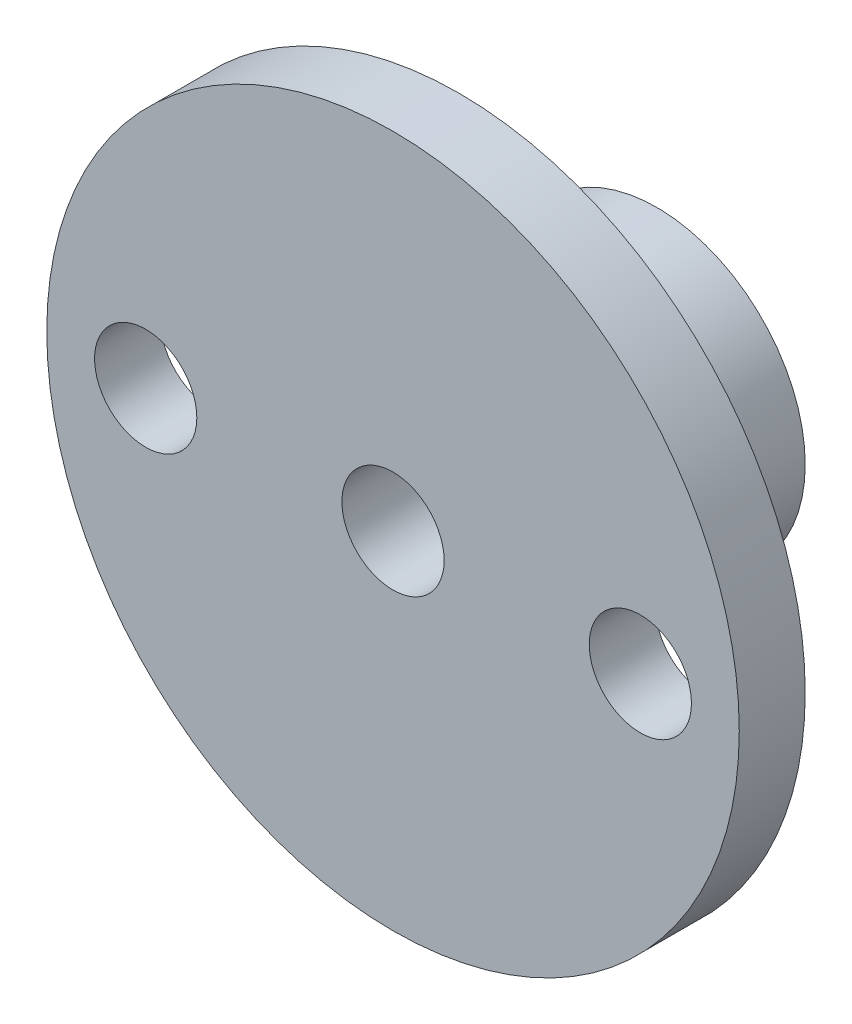
ISO-10303-21;
HEADER;
FILE_DESCRIPTION(('STEP AP214'),'2;1');
FILE_NAME('part.step','',(''),(''),'','','');
FILE_SCHEMA(('AUTOMOTIVE_DESIGN { 1 0 10303 214 1 1 1 1 }'));
ENDSEC;
DATA;
#1=APPLICATION_CONTEXT('core data for automotive mechanical design processes');
#2=APPLICATION_PROTOCOL_DEFINITION('international standard','automotive_design',2000,#1);
#3=PRODUCT_CONTEXT('',#1,'mechanical');
#4=PRODUCT('Part','Part','',(#3));
#5=PRODUCT_RELATED_PRODUCT_CATEGORY('part','',(#4));
#6=PRODUCT_DEFINITION_FORMATION('','',#4);
#7=PRODUCT_DEFINITION_CONTEXT('part definition',#1,'design');
#8=PRODUCT_DEFINITION('design','',#6,#7);
#9=PRODUCT_DEFINITION_SHAPE('','',#8);
#10=(LENGTH_UNIT() NAMED_UNIT(*) SI_UNIT(.MILLI.,.METRE.));
#11=(NAMED_UNIT(*) PLANE_ANGLE_UNIT() SI_UNIT($,.RADIAN.));
#12=(NAMED_UNIT(*) SI_UNIT($,.STERADIAN.) SOLID_ANGLE_UNIT());
#13=UNCERTAINTY_MEASURE_WITH_UNIT(LENGTH_MEASURE(1.E-05),#10,'distance_accuracy_value','');
#14=(GEOMETRIC_REPRESENTATION_CONTEXT(3) GLOBAL_UNCERTAINTY_ASSIGNED_CONTEXT((#13)) GLOBAL_UNIT_ASSIGNED_CONTEXT((#10,
#11,#12)) REPRESENTATION_CONTEXT('',''));
#15=CARTESIAN_POINT('',(0.,0.,0.));
#16=DIRECTION('',(0.,0.,1.));
#17=DIRECTION('',(1.,0.,0.));
#18=AXIS2_PLACEMENT_3D('',#15,#16,#17);
#19=CARTESIAN_POINT('',(0.,0.,6.));
#20=DIRECTION('',(0.,0.,-1.));
#21=DIRECTION('',(-1.,0.,0.));
#22=AXIS2_PLACEMENT_3D('',#19,#20,#21);
#23=CYLINDRICAL_SURFACE('',#22,4.5);
#24=CARTESIAN_POINT('',(0.,-4.5,4.5));
#25=CARTESIAN_POINT('',(0.0818450443300831,-4.50000022951416,4.50000038059746));
#26=CARTESIAN_POINT('',(0.163687791807823,-4.49774654261317,4.49327960080918));
#27=CARTESIAN_POINT('',(0.324962641309457,-4.48897815304921,4.46665633677417));
#28=CARTESIAN_POINT('',(0.404394492178225,-4.48246300803229,4.44675248407662));
#29=CARTESIAN_POINT('',(0.558499184252662,-4.46587961859664,4.39452113492393));
#30=CARTESIAN_POINT('',(0.63317973882905,-4.4558173159628,4.36221440631109));
#31=CARTESIAN_POINT('',(0.776062405207986,-4.43316668576013,4.28618824074248));
#32=CARTESIAN_POINT('',(0.844263235438057,-4.42057786001667,4.2424665524961));
#33=CARTESIAN_POINT('',(0.974612512533398,-4.39371141664507,4.14326129271187));
#34=CARTESIAN_POINT('',(1.03650555044746,-4.37939334695677,4.08745314860926));
#35=CARTESIAN_POINT('',(1.15024903905312,-4.35090472174682,3.96634926794015));
#36=CARTESIAN_POINT('',(1.20209727823419,-4.33673419935824,3.90105144760723));
#37=CARTESIAN_POINT('',(1.29573741334179,-4.30969998715911,3.76052232720531));
#38=CARTESIAN_POINT('',(1.33719728733155,-4.29688558913532,3.68505939040182));
#39=CARTESIAN_POINT('',(1.40672831081658,-4.27462958127902,3.52773585831218));
#40=CARTESIAN_POINT('',(1.43480354608015,-4.26518694241118,3.44587722425589));
#41=CARTESIAN_POINT('',(1.47581019226374,-4.25116954904066,3.28099016775493));
#42=CARTESIAN_POINT('',(1.48922017240765,-4.24644143654417,3.1980941872664));
#43=CARTESIAN_POINT('',(1.50201168500171,-4.24193484944261,3.03110436876618));
#44=CARTESIAN_POINT('',(1.50139755240708,-4.24215484534095,2.94701090893622));
#45=CARTESIAN_POINT('',(1.48652985555513,-4.2473852251227,2.78409505433397));
#46=CARTESIAN_POINT('',(1.47290086975049,-4.25217623801299,2.70520739562147));
#47=CARTESIAN_POINT('',(1.43340924427412,-4.26564986586826,2.55090987058975));
#48=CARTESIAN_POINT('',(1.4075451398878,-4.27433294676161,2.4755004218474));
#49=CARTESIAN_POINT('',(1.34390858709031,-4.29476866696873,2.32888087561278));
#50=CARTESIAN_POINT('',(1.30595107306089,-4.30656848689676,2.25775796179571));
#51=CARTESIAN_POINT('',(1.21933365945471,-4.3318883786359,2.12269363758041));
#52=CARTESIAN_POINT('',(1.17067066854601,-4.34540894685695,2.05875430959993));
#53=CARTESIAN_POINT('',(1.06102399902335,-4.37350993751611,1.93636260275884));
#54=CARTESIAN_POINT('',(0.999529725114466,-4.38810884032264,1.8783709582364));
#55=CARTESIAN_POINT('',(0.867509354955094,-4.41610407580555,1.7734031000049));
#56=CARTESIAN_POINT('',(0.79698239349122,-4.42950029307101,1.72642794275326));
#57=CARTESIAN_POINT('',(0.6479214195694,-4.4537566190669,1.6444555496474));
#58=CARTESIAN_POINT('',(0.569314914624503,-4.46459025012059,1.6095817629889));
#59=CARTESIAN_POINT('',(0.40690362504676,-4.48230850716652,1.55369523906643));
#60=CARTESIAN_POINT('',(0.323100657232429,-4.48919450482319,1.53267768686484));
#61=CARTESIAN_POINT('',(0.156575744293954,-4.49801440607161,1.50591650096646));
#62=CARTESIAN_POINT('',(0.0739643997972675,-4.50015002750592,1.49955028624087));
#63=CARTESIAN_POINT('',(-0.0911626049403579,-4.49983354042241,1.5004990103977));
#64=CARTESIAN_POINT('',(-0.173678278979477,-4.49738220629043,1.50781163996982));
#65=CARTESIAN_POINT('',(-0.333779799456385,-4.48830037075656,1.53541786160394));
#66=CARTESIAN_POINT('',(-0.411439210252267,-4.48179298066788,1.55532930907424));
#67=CARTESIAN_POINT('',(-0.562283937869362,-4.46537770245105,1.60709016670009));
#68=CARTESIAN_POINT('',(-0.635468682762911,-4.45546938070013,1.63894109920168));
#69=CARTESIAN_POINT('',(-0.777432444589911,-4.43293396930935,1.71460564776118));
#70=CARTESIAN_POINT('',(-0.846044938825722,-4.42024222133679,1.75871188992476));
#71=CARTESIAN_POINT('',(-0.975097245203381,-4.39357880874393,1.85729122502023));
#72=CARTESIAN_POINT('',(-1.03553455169337,-4.37960675390741,1.91176748404765));
#73=CARTESIAN_POINT('',(-1.14937876170945,-4.35115271970667,2.03246812650988));
#74=CARTESIAN_POINT('',(-1.20234145386866,-4.33667641631142,2.09911384039029));
#75=CARTESIAN_POINT('',(-1.29638628348536,-4.30949959942063,2.24065735171633));
#76=CARTESIAN_POINT('',(-1.33746832189652,-4.29679910073003,2.31555521795112));
#77=CARTESIAN_POINT('',(-1.40639539562454,-4.27473587687075,2.47150952293484));
#78=CARTESIAN_POINT('',(-1.43426719824753,-4.26536641189468,2.55255311875315));
#79=CARTESIAN_POINT('',(-1.47584200013904,-4.25116248459674,2.7185679750662));
#80=CARTESIAN_POINT('',(-1.48955138243091,-4.24632597935459,2.80353744810653));
#81=CARTESIAN_POINT('',(-1.50191442371601,-4.24196788311266,2.97029564406138));
#82=CARTESIAN_POINT('',(-1.5013053859626,-4.24218600386123,3.05202351043024));
#83=CARTESIAN_POINT('',(-1.48686344017304,-4.24726904735801,3.21414761238309));
#84=CARTESIAN_POINT('',(-1.47303131918788,-4.25213369354042,3.29454392693263));
#85=CARTESIAN_POINT('',(-1.43305771969402,-4.26576786457337,3.45020349450371));
#86=CARTESIAN_POINT('',(-1.40715501902327,-4.27446147033716,3.52553523750675));
#87=CARTESIAN_POINT('',(-1.34396904863962,-4.29474598227703,3.6708411104074));
#88=CARTESIAN_POINT('',(-1.30668325283071,-4.3063375314509,3.74081404678201));
#89=CARTESIAN_POINT('',(-1.21989103887515,-4.33174243839069,3.87672550488437));
#90=CARTESIAN_POINT('',(-1.16992236414687,-4.34563067463205,3.94235475284758));
#91=CARTESIAN_POINT('',(-1.05996432470347,-4.37375034424879,4.0645347200763));
#92=CARTESIAN_POINT('',(-0.999972126677224,-4.38798187368558,4.12108286353211));
#93=CARTESIAN_POINT('',(-0.868862335381034,-4.41585045788316,4.22571661843377));
#94=CARTESIAN_POINT('',(-0.797402270249595,-4.42944272701885,4.2733865216265));
#95=CARTESIAN_POINT('',(-0.647036036109939,-4.45388986758918,4.35598564327597));
#96=CARTESIAN_POINT('',(-0.568131777198525,-4.46474543861895,4.39091811888306));
#97=CARTESIAN_POINT('',(-0.408740470801466,-4.48208272602813,4.44558244873301));
#98=CARTESIAN_POINT('',(-0.328481636514615,-4.48873818633784,4.46592369939507));
#99=CARTESIAN_POINT('',(-0.165480624015372,-4.49769610596333,4.49313042101569));
#100=CARTESIAN_POINT('',(-0.0827391383531211,-4.49999976797857,4.49999961524481));
#101=CARTESIAN_POINT('',(0.,-4.5,4.5));
#102=B_SPLINE_CURVE_WITH_KNOTS('',3,(#24,#25,#26,#27,#28,#29,#30,#31,#32,#33,#34,#35,#36,#37,
#38,#39,#40,#41,#42,#43,#44,#45,#46,#47,#48,#49,#50,#51,#52,#53,#54,#55,#56,#57,#58,#59,#60,#61,
#62,#63,#64,#65,#66,#67,#68,#69,#70,#71,#72,#73,#74,#75,#76,#77,#78,#79,#80,#81,#82,#83,#84,#85,
#86,#87,#88,#89,#90,#91,#92,#93,#94,#95,#96,#97,#98,#99,#100,#101),.UNSPECIFIED.,.T.,.F.,(4,2,2,
2,2,2,2,2,2,2,2,2,2,2,2,2,2,2,2,2,2,2,2,2,2,2,2,2,2,2,2,2,2,2,2,2,2,2,4),(0.,0.245230659039016,
0.490486777901281,0.735334009305411,0.98022956669865,1.23277026424134,1.48536649931295,
1.74522577235206,2.0050056703925,2.2560288861276,2.50697450981228,2.7464523982692,
2.98595896283223,3.22932256732696,3.47275653837311,3.7288995871705,3.98506718949927,
4.24377608475536,4.50239503315813,4.74980374762755,4.99717069746265,5.2373723696732,
5.47760467926156,5.72415599765605,5.97078271232837,6.22861534321128,6.48645012352495,
6.74376020740156,7.0009542705876,7.24493499096387,7.48890119027063,7.72823380620626,
7.96761957263966,8.21745100037707,8.46735316685668,8.72699491252651,8.98657021728684,
9.23454837560721,9.4824579905721),.UNSPECIFIED.);
#103=CARTESIAN_POINT('',(0.,-4.5,4.5));
#104=VERTEX_POINT('',#103);
#105=EDGE_CURVE('E72',#104,#104,#102,.T.);
#106=ORIENTED_EDGE('',*,*,#105,.T.);
#107=EDGE_LOOP('',(#106));
#108=FACE_BOUND('',#107,.T.);
#109=CARTESIAN_POINT('',(0.,0.,6.));
#110=DIRECTION('',(0.,0.,1.));
#111=DIRECTION('',(1.,0.,0.));
#112=AXIS2_PLACEMENT_3D('',#109,#110,#111);
#113=CIRCLE('',#112,4.5);
#114=CARTESIAN_POINT('',(4.5,0.,6.));
#115=VERTEX_POINT('',#114);
#116=EDGE_CURVE('E10',#115,#115,#113,.T.);
#117=ORIENTED_EDGE('',*,*,#116,.F.);
#118=EDGE_LOOP('',(#117));
#119=FACE_BOUND('',#118,.T.);
#120=CARTESIAN_POINT('',(0.,0.,0.));
#121=DIRECTION('',(0.,0.,1.));
#122=DIRECTION('',(1.,0.,0.));
#123=AXIS2_PLACEMENT_3D('',#120,#121,#122);
#124=CIRCLE('',#123,4.5);
#125=CARTESIAN_POINT('',(4.5,0.,0.));
#126=VERTEX_POINT('',#125);
#127=EDGE_CURVE('E42',#126,#126,#124,.T.);
#128=ORIENTED_EDGE('',*,*,#127,.T.);
#129=EDGE_LOOP('',(#128));
#130=FACE_BOUND('',#129,.T.);
#131=ADVANCED_FACE('F30',(#108,#119,#130),#23,.T.);
#132=CARTESIAN_POINT('',(0.,0.,0.));
#133=DIRECTION('',(0.,0.,1.));
#134=DIRECTION('',(1.,0.,0.));
#135=AXIS2_PLACEMENT_3D('',#132,#133,#134);
#136=PLANE('',#135);
#137=CARTESIAN_POINT('',(0.,0.,0.));
#138=DIRECTION('',(0.,0.,1.));
#139=DIRECTION('',(1.,0.,0.));
#140=AXIS2_PLACEMENT_3D('',#137,#138,#139);
#141=CIRCLE('',#140,1.55);
#142=CARTESIAN_POINT('',(1.55,0.,0.));
#143=VERTEX_POINT('',#142);
#144=EDGE_CURVE('E54',#143,#143,#141,.T.);
#145=ORIENTED_EDGE('',*,*,#144,.T.);
#146=EDGE_LOOP('',(#145));
#147=FACE_BOUND('',#146,.T.);
#148=ORIENTED_EDGE('',*,*,#127,.F.);
#149=EDGE_LOOP('',(#148));
#150=FACE_BOUND('',#149,.T.);
#151=ADVANCED_FACE('F99',(#147,#150),#136,.F.);
#152=CARTESIAN_POINT('',(0.,0.,6.));
#153=DIRECTION('',(0.,0.,1.));
#154=DIRECTION('',(1.,0.,0.));
#155=AXIS2_PLACEMENT_3D('',#152,#153,#154);
#156=PLANE('',#155);
#157=CARTESIAN_POINT('',(7.5,0.,6.));
#158=DIRECTION('',(0.,0.,1.));
#159=DIRECTION('',(1.,0.,0.));
#160=AXIS2_PLACEMENT_3D('',#157,#158,#159);
#161=CIRCLE('',#160,1.55);
#162=CARTESIAN_POINT('',(9.05,0.,6.));
#163=VERTEX_POINT('',#162);
#164=EDGE_CURVE('E66',#163,#163,#161,.T.);
#165=ORIENTED_EDGE('',*,*,#164,.T.);
#166=EDGE_LOOP('',(#165));
#167=FACE_BOUND('',#166,.T.);
#168=CARTESIAN_POINT('',(-7.5,0.,6.));
#169=DIRECTION('',(0.,0.,1.));
#170=DIRECTION('',(1.,0.,0.));
#171=AXIS2_PLACEMENT_3D('',#168,#169,#170);
#172=CIRCLE('',#171,1.55);
#173=CARTESIAN_POINT('',(-5.95,0.,6.));
#174=VERTEX_POINT('',#173);
#175=EDGE_CURVE('E60',#174,#174,#172,.T.);
#176=ORIENTED_EDGE('',*,*,#175,.T.);
#177=EDGE_LOOP('',(#176));
#178=FACE_BOUND('',#177,.T.);
#179=CARTESIAN_POINT('',(0.,0.,6.));
#180=DIRECTION('',(0.,0.,1.));
#181=DIRECTION('',(1.,0.,0.));
#182=AXIS2_PLACEMENT_3D('',#179,#180,#181);
#183=CIRCLE('',#182,10.5);
#184=CARTESIAN_POINT('',(10.5,0.,6.));
#185=VERTEX_POINT('',#184);
#186=EDGE_CURVE('E51',#185,#185,#183,.T.);
#187=ORIENTED_EDGE('',*,*,#186,.F.);
#188=EDGE_LOOP('',(#187));
#189=FACE_BOUND('',#188,.T.);
#190=ORIENTED_EDGE('',*,*,#116,.T.);
#191=EDGE_LOOP('',(#190));
#192=FACE_BOUND('',#191,.T.);
#193=ADVANCED_FACE('F95',(#167,#178,#189,#192),#156,.F.);
#194=CARTESIAN_POINT('',(0.,0.,8.));
#195=DIRECTION('',(0.,0.,-1.));
#196=DIRECTION('',(-1.,0.,0.));
#197=AXIS2_PLACEMENT_3D('',#194,#195,#196);
#198=CYLINDRICAL_SURFACE('',#197,10.5);
#199=CARTESIAN_POINT('',(0.,0.,8.));
#200=DIRECTION('',(0.,0.,1.));
#201=DIRECTION('',(1.,0.,0.));
#202=AXIS2_PLACEMENT_3D('',#199,#200,#201);
#203=CIRCLE('',#202,10.5);
#204=CARTESIAN_POINT('',(10.5,0.,8.));
#205=VERTEX_POINT('',#204);
#206=EDGE_CURVE('E46',#205,#205,#203,.T.);
#207=ORIENTED_EDGE('',*,*,#206,.F.);
#208=EDGE_LOOP('',(#207));
#209=FACE_BOUND('',#208,.T.);
#210=ORIENTED_EDGE('',*,*,#186,.T.);
#211=EDGE_LOOP('',(#210));
#212=FACE_BOUND('',#211,.T.);
#213=ADVANCED_FACE('F98',(#209,#212),#198,.T.);
#214=CARTESIAN_POINT('',(0.,0.,8.));
#215=DIRECTION('',(0.,0.,1.));
#216=DIRECTION('',(1.,0.,0.));
#217=AXIS2_PLACEMENT_3D('',#214,#215,#216);
#218=PLANE('',#217);
#219=CARTESIAN_POINT('',(7.5,0.,8.));
#220=DIRECTION('',(0.,0.,1.));
#221=DIRECTION('',(1.,0.,0.));
#222=AXIS2_PLACEMENT_3D('',#219,#220,#221);
#223=CIRCLE('',#222,1.55);
#224=CARTESIAN_POINT('',(9.05,0.,8.));
#225=VERTEX_POINT('',#224);
#226=EDGE_CURVE('E69',#225,#225,#223,.T.);
#227=ORIENTED_EDGE('',*,*,#226,.F.);
#228=EDGE_LOOP('',(#227));
#229=FACE_BOUND('',#228,.T.);
#230=CARTESIAN_POINT('',(-7.5,0.,8.));
#231=DIRECTION('',(0.,0.,1.));
#232=DIRECTION('',(1.,0.,0.));
#233=AXIS2_PLACEMENT_3D('',#230,#231,#232);
#234=CIRCLE('',#233,1.55);
#235=CARTESIAN_POINT('',(-5.95,0.,8.));
#236=VERTEX_POINT('',#235);
#237=EDGE_CURVE('E63',#236,#236,#234,.T.);
#238=ORIENTED_EDGE('',*,*,#237,.F.);
#239=EDGE_LOOP('',(#238));
#240=FACE_BOUND('',#239,.T.);
#241=CARTESIAN_POINT('',(0.,0.,8.));
#242=DIRECTION('',(0.,0.,1.));
#243=DIRECTION('',(1.,0.,0.));
#244=AXIS2_PLACEMENT_3D('',#241,#242,#243);
#245=CIRCLE('',#244,1.55);
#246=CARTESIAN_POINT('',(1.55,0.,8.));
#247=VERTEX_POINT('',#246);
#248=EDGE_CURVE('E57',#247,#247,#245,.T.);
#249=ORIENTED_EDGE('',*,*,#248,.F.);
#250=EDGE_LOOP('',(#249));
#251=FACE_BOUND('',#250,.T.);
#252=ORIENTED_EDGE('',*,*,#206,.T.);
#253=EDGE_LOOP('',(#252));
#254=FACE_BOUND('',#253,.T.);
#255=ADVANCED_FACE('F93',(#229,#240,#251,#254),#218,.T.);
#256=CARTESIAN_POINT('',(0.,0.,0.));
#257=DIRECTION('',(0.,0.,1.));
#258=DIRECTION('',(1.,0.,0.));
#259=AXIS2_PLACEMENT_3D('',#256,#257,#258);
#260=CYLINDRICAL_SURFACE('',#259,1.55);
#261=CARTESIAN_POINT('',(0.,-1.55,4.5));
#262=CARTESIAN_POINT('',(-0.0676355330274366,-1.54999081843046,4.49999076368759));
#263=CARTESIAN_POINT('',(-0.135385038064904,-1.54552730815956,4.49537962706916));
#264=CARTESIAN_POINT('',(-0.268656128092148,-1.52802940917958,4.47728767559424));
#265=CARTESIAN_POINT('',(-0.334170585245087,-1.51496988620329,4.46378085016549));
#266=CARTESIAN_POINT('',(-0.460531661005094,-1.48143605448111,4.42904623801899));
#267=CARTESIAN_POINT('',(-0.521408709249814,-1.46101625363012,4.40787520512207));
#268=CARTESIAN_POINT('',(-0.637888892089841,-1.41405401872415,4.35907782461948));
#269=CARTESIAN_POINT('',(-0.693492939511155,-1.38751264713421,4.33145259719855));
#270=CARTESIAN_POINT('',(-0.820581634788789,-1.31770149581901,4.25856612544725));
#271=CARTESIAN_POINT('',(-0.889256412159932,-1.27203025962067,4.21071351864878));
#272=CARTESIAN_POINT('',(-1.01520576989899,-1.17399180153672,4.1072649019925));
#273=CARTESIAN_POINT('',(-1.07244587684376,-1.12160509050306,4.05164631060456));
#274=CARTESIAN_POINT('',(-1.15905645809111,-1.03036877243889,3.95360727945747));
#275=CARTESIAN_POINT('',(-1.19144642006318,-0.992635667006653,3.91275281029674));
#276=CARTESIAN_POINT('',(-1.25138700905586,-0.915914787426984,3.82867328414724));
#277=CARTESIAN_POINT('',(-1.27893455042558,-0.8769262318756,3.78544673849274));
#278=CARTESIAN_POINT('',(-1.32929209619449,-0.798530053193021,3.69683318220178));
#279=CARTESIAN_POINT('',(-1.35210921725435,-0.7591231547276,3.65144954512515));
#280=CARTESIAN_POINT('',(-1.39316851278601,-0.680824833031678,3.55828190125809));
#281=CARTESIAN_POINT('',(-1.41141486057361,-0.641932970513509,3.51050013227713));
#282=CARTESIAN_POINT('',(-1.43796585474672,-0.579220247170031,3.42829625229903));
#283=CARTESIAN_POINT('',(-1.44754930690894,-0.554734187823024,3.39479308281068));
#284=CARTESIAN_POINT('',(-1.46463329583353,-0.507900505941637,3.32575704458973));
#285=CARTESIAN_POINT('',(-1.4721343935952,-0.485552308519332,3.29022472563902));
#286=CARTESIAN_POINT('',(-1.48283152463227,-0.451580002246385,3.22776570530092));
#287=CARTESIAN_POINT('',(-1.48664094036618,-0.438782056021784,3.20159858855609));
#288=CARTESIAN_POINT('',(-1.4929607756499,-0.416772507905548,3.14764866260204));
#289=CARTESIAN_POINT('',(-1.49547530893552,-0.407549571880429,3.11987128590343));
#290=CARTESIAN_POINT('',(-1.49854011071256,-0.396112814231927,3.06964887056954));
#291=CARTESIAN_POINT('',(-1.49941413846041,-0.392757694838758,3.04749491759403));
#292=CARTESIAN_POINT('',(-1.50016193526527,-0.389893808440604,3.00293704360337));
#293=CARTESIAN_POINT('',(-1.50003712302609,-0.390379586000367,2.98053352224507));
#294=CARTESIAN_POINT('',(-1.4988087528499,-0.39506514541176,2.93625948035088));
#295=CARTESIAN_POINT('',(-1.49770901081175,-0.399250447051156,2.91438722300598));
#296=CARTESIAN_POINT('',(-1.49463886434278,-0.410597810421201,2.8714768493076));
#297=CARTESIAN_POINT('',(-1.49266644232335,-0.417766767909632,2.85044078974705));
#298=CARTESIAN_POINT('',(-1.48421675577554,-0.447289588754999,2.77634201819846));
#299=CARTESIAN_POINT('',(-1.4755864871079,-0.475563845772816,2.72599318100967));
#300=CARTESIAN_POINT('',(-1.45432019738923,-0.537178739458939,2.62929998699831));
#301=CARTESIAN_POINT('',(-1.44164953074072,-0.570561845752358,2.58299484896806));
#302=CARTESIAN_POINT('',(-1.41119167479362,-0.642413158273151,2.48893535236883));
#303=CARTESIAN_POINT('',(-1.39304229169765,-0.681067117658285,2.44143635457927));
#304=CARTESIAN_POINT('',(-1.3522289371783,-0.758893263977788,2.34881744103721));
#305=CARTESIAN_POINT('',(-1.32956049851529,-0.798065927609299,2.30369993573671));
#306=CARTESIAN_POINT('',(-1.27968080639221,-0.875809766059643,2.21580694970387));
#307=CARTESIAN_POINT('',(-1.25248535967426,-0.914382540158545,2.17302398471942));
#308=CARTESIAN_POINT('',(-1.19335707270961,-0.990310294747422,2.08977861731749));
#309=CARTESIAN_POINT('',(-1.16142733296677,-1.02766605288111,2.04931472000336));
#310=CARTESIAN_POINT('',(-1.07706051760185,-1.11702184078186,1.95325442762864));
#311=CARTESIAN_POINT('',(-1.02187542128094,-1.16801390921705,1.89907974324001));
#312=CARTESIAN_POINT('',(-0.900638243110895,-1.26384571665305,1.79789154380219));
#313=CARTESIAN_POINT('',(-0.83460036052109,-1.30869335597762,1.75086882423208));
#314=CARTESIAN_POINT('',(-0.707364744329703,-1.38066834191321,1.67567552744845));
#315=CARTESIAN_POINT('',(-0.648265804662647,-1.40952616528861,1.64563098065843));
#316=CARTESIAN_POINT('',(-0.524040425774734,-1.46026443944318,1.59290235946652));
#317=CARTESIAN_POINT('',(-0.458917640809076,-1.48214908501786,1.57021385980509));
#318=CARTESIAN_POINT('',(-0.323357261638141,-1.51752526844459,1.53357374645812));
#319=CARTESIAN_POINT('',(-0.252877834811499,-1.53094103013228,1.51970100549066));
#320=CARTESIAN_POINT('',(-0.109496119878139,-1.54780630384202,1.50226522276312));
#321=CARTESIAN_POINT('',(-0.0365960895639781,-1.55126485309303,1.49869283233536));
#322=CARTESIAN_POINT('',(0.0984919810263352,-1.5481331430729,1.50192922429916));
#323=CARTESIAN_POINT('',(0.160752682035289,-1.54288022059812,1.50735642672839));
#324=CARTESIAN_POINT('',(0.283103371878392,-1.52517972072979,1.5256599529116));
#325=CARTESIAN_POINT('',(0.343193125040594,-1.51273136469899,1.53853708284245));
#326=CARTESIAN_POINT('',(0.459883486074441,-1.48144097259974,1.57094947036583));
#327=CARTESIAN_POINT('',(0.51647755851908,-1.46258736499715,1.59049677838429));
#328=CARTESIAN_POINT('',(0.625185056628177,-1.41953103602407,1.63522737415673));
#329=CARTESIAN_POINT('',(0.677296955637218,-1.39532650203913,1.66041257176986));
#330=CARTESIAN_POINT('',(0.801143016952371,-1.32955531942303,1.72903211765454));
#331=CARTESIAN_POINT('',(0.869873446620252,-1.28531444673555,1.7753396197126));
#332=CARTESIAN_POINT('',(0.996221572518743,-1.19010260703674,1.87568410667081));
#333=CARTESIAN_POINT('',(1.05380501309096,-1.13911168031631,1.92974405643647));
#334=CARTESIAN_POINT('',(1.17684019417416,-1.01377239339767,2.06401686627486));
#335=CARTESIAN_POINT('',(1.23776700867064,-0.937582193271958,2.14667831584558));
#336=CARTESIAN_POINT('',(1.3151807465359,-0.821565625582562,2.27692370827614));
#337=CARTESIAN_POINT('',(1.33865419259973,-0.782609044063364,2.3213760810914));
#338=CARTESIAN_POINT('',(1.38111453148267,-0.704958805751522,2.41258360426441));
#339=CARTESIAN_POINT('',(1.40010488794504,-0.666264968560328,2.45933694291689));
#340=CARTESIAN_POINT('',(1.42865852656184,-0.601900746736164,2.54149913709553));
#341=CARTESIAN_POINT('',(1.43934747871827,-0.575770422288713,2.57616168570283));
#342=CARTESIAN_POINT('',(1.45846916957239,-0.525437401582563,2.64752737546126));
#343=CARTESIAN_POINT('',(1.46690169224684,-0.501234890042081,2.68423071158479));
#344=CARTESIAN_POINT('',(1.47915836826864,-0.463531921663727,2.74932207824781));
#345=CARTESIAN_POINT('',(1.48360817410217,-0.448980349699616,2.77696988349882));
#346=CARTESIAN_POINT('',(1.49107253782405,-0.423530203157789,2.83408964249794));
#347=CARTESIAN_POINT('',(1.4940916438818,-0.412620085612812,2.86355547451738));
#348=CARTESIAN_POINT('',(1.49778533654472,-0.398968516937341,2.91565703866731));
#349=CARTESIAN_POINT('',(1.49888133135799,-0.394790034674028,2.93787033212664));
#350=CARTESIAN_POINT('',(1.50006670712492,-0.390264522703645,2.98268993015208));
#351=CARTESIAN_POINT('',(1.50015818188904,-0.389909523400769,3.005295318828));
#352=CARTESIAN_POINT('',(1.49932930092276,-0.393081437578558,3.05015589078406));
#353=CARTESIAN_POINT('',(1.4984106800186,-0.396601695367221,3.07241160812662));
#354=CARTESIAN_POINT('',(1.49565869150686,-0.40685869702317,3.11613176726924));
#355=CARTESIAN_POINT('',(1.49382290141956,-0.41360395691013,3.13759395104915));
#356=CARTESIAN_POINT('',(1.4862845739818,-0.440249186294608,3.20856756053518));
#357=CARTESIAN_POINT('',(1.47874616727958,-0.465438051484511,3.25580647617895));
#358=CARTESIAN_POINT('',(1.46016045684435,-0.520882549801477,3.34654557972253));
#359=CARTESIAN_POINT('',(1.4490845435901,-0.551178508706016,3.39001147521416));
#360=CARTESIAN_POINT('',(1.42262028470986,-0.61643405505558,3.47793021216763));
#361=CARTESIAN_POINT('',(1.40695141884877,-0.651572172361468,3.52216831315903));
#362=CARTESIAN_POINT('',(1.37182844375827,-0.722612129331189,3.60848745748285));
#363=CARTESIAN_POINT('',(1.35237085660005,-0.75851464351006,3.6505664736545));
#364=CARTESIAN_POINT('',(1.28834402847887,-0.865777158040825,3.77378058596444));
#365=CARTESIAN_POINT('',(1.23801928130953,-0.936960087552604,3.85222537758818));
#366=CARTESIAN_POINT('',(1.13058528030718,-1.06301849612507,3.98895814812841));
#367=CARTESIAN_POINT('',(1.07590721072428,-1.11866431650513,4.04845021921719));
#368=CARTESIAN_POINT('',(0.954447838165032,-1.22391085594574,4.16009192792526));
#369=CARTESIAN_POINT('',(0.887682056914328,-1.27351919263805,4.21225083115024));
#370=CARTESIAN_POINT('',(0.759622362999432,-1.35265987520472,4.29510454046085));
#371=CARTESIAN_POINT('',(0.700925812060848,-1.38414365789187,4.32793739889534));
#372=CARTESIAN_POINT('',(0.576916619219204,-1.44023569865417,4.38630627969614));
#373=CARTESIAN_POINT('',(0.511609170745664,-1.4648492976012,4.41184797055947));
#374=CARTESIAN_POINT('',(0.38551316044794,-1.50251917851428,4.45089136321836));
#375=CARTESIAN_POINT('',(0.325447285448168,-1.51673524769351,4.46560339794699));
#376=CARTESIAN_POINT('',(0.202808330107078,-1.53792449462109,4.48752141126474));
#377=CARTESIAN_POINT('',(0.1402427016429,-1.54491774219481,4.49474818906005));
#378=CARTESIAN_POINT('',(0.0516188490255356,-1.54935797402675,4.49933651331712));
#379=CARTESIAN_POINT('',(0.0258177278832544,-1.55000350477409,4.50000352567046));
#380=CARTESIAN_POINT('',(0.,-1.55,4.5));
#381=B_SPLINE_CURVE_WITH_KNOTS('',3,(#261,#262,#263,#264,#265,#266,#267,#268,#269,#270,#271,
#272,#273,#274,#275,#276,#277,#278,#279,#280,#281,#282,#283,#284,#285,#286,#287,#288,#289,#290,
#291,#292,#293,#294,#295,#296,#297,#298,#299,#300,#301,#302,#303,#304,#305,#306,#307,#308,#309,
#310,#311,#312,#313,#314,#315,#316,#317,#318,#319,#320,#321,#322,#323,#324,#325,#326,#327,#328,
#329,#330,#331,#332,#333,#334,#335,#336,#337,#338,#339,#340,#341,#342,#343,#344,#345,#346,#347,
#348,#349,#350,#351,#352,#353,#354,#355,#356,#357,#358,#359,#360,#361,#362,#363,#364,#365,#366,
#367,#368,#369,#370,#371,#372,#373,#374,#375,#376,#377,#378,#379,#380),.UNSPECIFIED.,.T.,.F.,(4,
2,2,2,2,2,2,2,2,2,2,2,2,2,2,2,2,2,2,2,2,2,2,2,2,2,2,2,2,2,2,2,2,2,2,2,2,2,2,2,2,2,2,2,2,2,2,2,2,
2,2,2,2,2,2,2,2,2,2,4),(0.,0.202814510369214,0.406224689313205,0.608158425619283,
0.810057140472106,1.09455653609654,1.37990111332596,1.57274966281357,1.76572065582805,
1.95839919330287,2.15090116032281,2.27858497539441,2.4062343581913,2.49419225375971,
2.58186896309507,2.64882662460042,2.7156891995928,2.78229122263704,2.8490480371617,
3.02281253929225,3.19810902344746,3.3894522776554,3.58098562755559,3.77186372235796,
3.96261735814802,4.23954415156447,4.51611147046008,4.73220774613689,4.94817378010334,
5.16604577824915,5.3837199719582,5.57096073943537,5.75822177253494,5.94582292075647,
6.13348771609461,6.41374072185356,6.69484175338964,7.07625320432193,7.2669191717874,
7.45743734471184,7.59146972942435,7.72551494137496,7.82002553343695,7.91423362831896,
7.98182424901707,8.04927395776677,8.11660800320233,8.18412084292244,8.34503439109423,
8.50728375933479,8.68292719058557,8.85873262372907,9.20903785981622,9.50242130990274,
9.79543066692567,10.0174065500662,10.239209385751,10.428776534471,10.61781551016,
10.6952335418529),.UNSPECIFIED.);
#382=CARTESIAN_POINT('',(0.,-1.55,4.5));
#383=VERTEX_POINT('',#382);
#384=EDGE_CURVE('E34',#383,#383,#381,.T.);
#385=ORIENTED_EDGE('',*,*,#384,.T.);
#386=EDGE_LOOP('',(#385));
#387=FACE_BOUND('',#386,.T.);
#388=ORIENTED_EDGE('',*,*,#144,.F.);
#389=EDGE_LOOP('',(#388));
#390=FACE_BOUND('',#389,.T.);
#391=ORIENTED_EDGE('',*,*,#248,.T.);
#392=EDGE_LOOP('',(#391));
#393=FACE_BOUND('',#392,.T.);
#394=ADVANCED_FACE('F88',(#387,#390,#393),#260,.F.);
#395=CARTESIAN_POINT('',(-7.5,0.,0.));
#396=DIRECTION('',(0.,0.,1.));
#397=DIRECTION('',(1.,0.,0.));
#398=AXIS2_PLACEMENT_3D('',#395,#396,#397);
#399=CYLINDRICAL_SURFACE('',#398,1.55);
#400=ORIENTED_EDGE('',*,*,#237,.T.);
#401=EDGE_LOOP('',(#400));
#402=FACE_BOUND('',#401,.T.);
#403=ORIENTED_EDGE('',*,*,#175,.F.);
#404=EDGE_LOOP('',(#403));
#405=FACE_BOUND('',#404,.T.);
#406=ADVANCED_FACE('F85',(#402,#405),#399,.F.);
#407=CARTESIAN_POINT('',(7.5,0.,0.));
#408=DIRECTION('',(0.,0.,1.));
#409=DIRECTION('',(1.,0.,0.));
#410=AXIS2_PLACEMENT_3D('',#407,#408,#409);
#411=CYLINDRICAL_SURFACE('',#410,1.55);
#412=ORIENTED_EDGE('',*,*,#226,.T.);
#413=EDGE_LOOP('',(#412));
#414=FACE_BOUND('',#413,.T.);
#415=ORIENTED_EDGE('',*,*,#164,.F.);
#416=EDGE_LOOP('',(#415));
#417=FACE_BOUND('',#416,.T.);
#418=ADVANCED_FACE('F80',(#414,#417),#411,.F.);
#419=CARTESIAN_POINT('',(0.,-10.,3.));
#420=DIRECTION('',(0.,1.,0.));
#421=DIRECTION('',(0.,0.,1.));
#422=AXIS2_PLACEMENT_3D('',#419,#420,#421);
#423=CYLINDRICAL_SURFACE('',#422,1.5);
#424=ORIENTED_EDGE('',*,*,#384,.F.);
#425=EDGE_LOOP('',(#424));
#426=FACE_BOUND('',#425,.T.);
#427=ORIENTED_EDGE('',*,*,#105,.F.);
#428=EDGE_LOOP('',(#427));
#429=FACE_BOUND('',#428,.T.);
#430=ADVANCED_FACE('F76',(#426,#429),#423,.F.);
#431=CLOSED_SHELL('',(#131,#151,#193,#213,#255,#394,#406,#418,#430));
#432=MANIFOLD_SOLID_BREP('B2',#431);
#433=ADVANCED_BREP_SHAPE_REPRESENTATION('',(#18,#432),#14);
#434=SHAPE_DEFINITION_REPRESENTATION(#9,#433);
ENDSEC;
END-ISO-10303-21;
